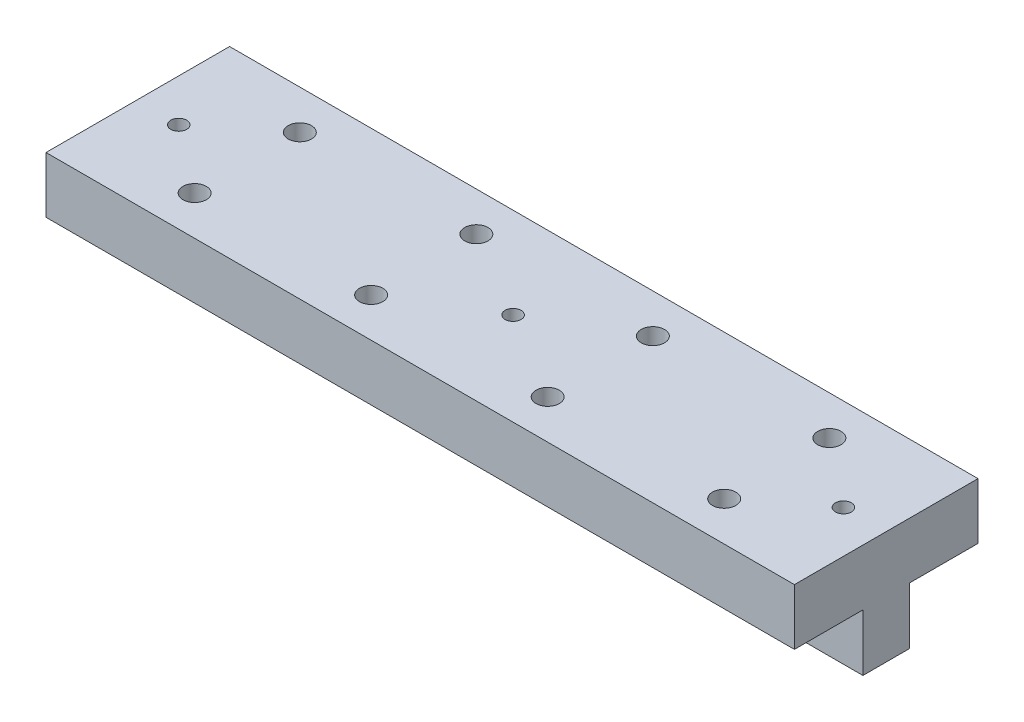
ISO-10303-21;
HEADER;
FILE_DESCRIPTION(('STEP AP214'),'2;1');
FILE_NAME('part.step','',(''),(''),'','','');
FILE_SCHEMA(('AUTOMOTIVE_DESIGN { 1 0 10303 214 1 1 1 1 }'));
ENDSEC;
DATA;
#1=APPLICATION_CONTEXT('core data for automotive mechanical design processes');
#2=APPLICATION_PROTOCOL_DEFINITION('international standard','automotive_design',2000,#1);
#3=PRODUCT_CONTEXT('',#1,'mechanical');
#4=PRODUCT('Part','Part','',(#3));
#5=PRODUCT_RELATED_PRODUCT_CATEGORY('part','',(#4));
#6=PRODUCT_DEFINITION_FORMATION('','',#4);
#7=PRODUCT_DEFINITION_CONTEXT('part definition',#1,'design');
#8=PRODUCT_DEFINITION('design','',#6,#7);
#9=PRODUCT_DEFINITION_SHAPE('','',#8);
#10=(LENGTH_UNIT() NAMED_UNIT(*) SI_UNIT(.MILLI.,.METRE.));
#11=(NAMED_UNIT(*) PLANE_ANGLE_UNIT() SI_UNIT($,.RADIAN.));
#12=(NAMED_UNIT(*) SI_UNIT($,.STERADIAN.) SOLID_ANGLE_UNIT());
#13=UNCERTAINTY_MEASURE_WITH_UNIT(LENGTH_MEASURE(1.E-05),#10,'distance_accuracy_value','');
#14=(GEOMETRIC_REPRESENTATION_CONTEXT(3) GLOBAL_UNCERTAINTY_ASSIGNED_CONTEXT((#13)) GLOBAL_UNIT_ASSIGNED_CONTEXT((#10,
#11,#12)) REPRESENTATION_CONTEXT('',''));
#15=CARTESIAN_POINT('',(0.,0.,0.));
#16=DIRECTION('',(0.,0.,1.));
#17=DIRECTION('',(1.,0.,0.));
#18=AXIS2_PLACEMENT_3D('',#15,#16,#17);
#19=CARTESIAN_POINT('',(-89.8910476017454,-16.65,-13.));
#20=DIRECTION('',(0.,1.,0.));
#21=DIRECTION('',(0.,0.,1.));
#22=AXIS2_PLACEMENT_3D('',#19,#20,#21);
#23=PLANE('',#22);
#24=CARTESIAN_POINT('',(-83.8910476017454,-16.65,-12.8014145682755));
#25=DIRECTION('',(0.,-1.,0.));
#26=DIRECTION('',(0.,0.,-1.));
#27=AXIS2_PLACEMENT_3D('',#24,#25,#26);
#28=CIRCLE('',#27,1.1303);
#29=CARTESIAN_POINT('',(-83.8910476017454,-16.65,-13.9317145682755));
#30=VERTEX_POINT('',#29);
#31=EDGE_CURVE('E470',#30,#30,#28,.T.);
#32=ORIENTED_EDGE('',*,*,#31,.T.);
#33=EDGE_LOOP('',(#32));
#34=FACE_BOUND('',#33,.T.);
#35=DIRECTION('',(-1.,0.,0.));
#36=VECTOR('',#35,1.);
#37=CARTESIAN_POINT('',(-89.8910476017454,-16.65,0.));
#38=LINE('',#37,#36);
#39=CARTESIAN_POINT('',(16.1089523982546,-16.65,0.));
#40=VERTEX_POINT('',#39);
#41=CARTESIAN_POINT('',(-89.8910476017454,-16.65,0.));
#42=VERTEX_POINT('',#41);
#43=EDGE_CURVE('E166',#40,#42,#38,.T.);
#44=ORIENTED_EDGE('',*,*,#43,.F.);
#45=DIRECTION('',(0.,0.,1.));
#46=VECTOR('',#45,1.);
#47=CARTESIAN_POINT('',(16.1089523982546,-16.65,-13.));
#48=LINE('',#47,#46);
#49=CARTESIAN_POINT('',(16.1089523982546,-16.65,-26.));
#50=VERTEX_POINT('',#49);
#51=EDGE_CURVE('E173',#50,#40,#48,.T.);
#52=ORIENTED_EDGE('',*,*,#51,.F.);
#53=DIRECTION('',(-1.,0.,0.));
#54=VECTOR('',#53,1.);
#55=CARTESIAN_POINT('',(-89.8910476017454,-16.65,-26.));
#56=LINE('',#55,#54);
#57=CARTESIAN_POINT('',(-89.8910476017454,-16.65,-26.));
#58=VERTEX_POINT('',#57);
#59=EDGE_CURVE('E121',#50,#58,#56,.T.);
#60=ORIENTED_EDGE('',*,*,#59,.T.);
#61=DIRECTION('',(0.,0.,1.));
#62=VECTOR('',#61,1.);
#63=CARTESIAN_POINT('',(-89.8910476017454,-16.65,-13.));
#64=LINE('',#63,#62);
#65=EDGE_CURVE('E170',#58,#42,#64,.T.);
#66=ORIENTED_EDGE('',*,*,#65,.T.);
#67=EDGE_LOOP('',(#44,#52,#60,#66));
#68=FACE_BOUND('',#67,.T.);
#69=CARTESIAN_POINT('',(-24.3910476017454,-16.65,-5.55));
#70=DIRECTION('',(0.,1.,0.));
#71=DIRECTION('',(0.,0.,1.));
#72=AXIS2_PLACEMENT_3D('',#69,#70,#71);
#73=CIRCLE('',#72,1.65);
#74=CARTESIAN_POINT('',(-24.3910476017454,-16.65,-3.9));
#75=VERTEX_POINT('',#74);
#76=EDGE_CURVE('E144',#75,#75,#73,.T.);
#77=ORIENTED_EDGE('',*,*,#76,.F.);
#78=EDGE_LOOP('',(#77));
#79=FACE_BOUND('',#78,.T.);
#80=CARTESIAN_POINT('',(0.608952398254592,-16.65,-5.55));
#81=DIRECTION('',(0.,1.,0.));
#82=DIRECTION('',(0.,0.,1.));
#83=AXIS2_PLACEMENT_3D('',#80,#81,#82);
#84=CIRCLE('',#83,1.65);
#85=CARTESIAN_POINT('',(0.608952398254592,-16.65,-3.9));
#86=VERTEX_POINT('',#85);
#87=EDGE_CURVE('E140',#86,#86,#84,.T.);
#88=ORIENTED_EDGE('',*,*,#87,.F.);
#89=EDGE_LOOP('',(#88));
#90=FACE_BOUND('',#89,.T.);
#91=CARTESIAN_POINT('',(-49.3910476017454,-16.65,-5.55));
#92=DIRECTION('',(0.,1.,0.));
#93=DIRECTION('',(0.,0.,1.));
#94=AXIS2_PLACEMENT_3D('',#91,#92,#93);
#95=CIRCLE('',#94,1.65);
#96=CARTESIAN_POINT('',(-49.3910476017454,-16.65,-3.9));
#97=VERTEX_POINT('',#96);
#98=EDGE_CURVE('E136',#97,#97,#95,.T.);
#99=ORIENTED_EDGE('',*,*,#98,.F.);
#100=EDGE_LOOP('',(#99));
#101=FACE_BOUND('',#100,.T.);
#102=CARTESIAN_POINT('',(-74.3910476017454,-16.65,-5.55));
#103=DIRECTION('',(0.,1.,0.));
#104=DIRECTION('',(0.,0.,1.));
#105=AXIS2_PLACEMENT_3D('',#102,#103,#104);
#106=CIRCLE('',#105,1.65);
#107=CARTESIAN_POINT('',(-74.3910476017454,-16.65,-3.9));
#108=VERTEX_POINT('',#107);
#109=EDGE_CURVE('E130',#108,#108,#106,.T.);
#110=ORIENTED_EDGE('',*,*,#109,.F.);
#111=EDGE_LOOP('',(#110));
#112=FACE_BOUND('',#111,.T.);
#113=CARTESIAN_POINT('',(-24.3910476017454,-16.65,-20.45));
#114=DIRECTION('',(0.,1.,0.));
#115=DIRECTION('',(0.,0.,1.));
#116=AXIS2_PLACEMENT_3D('',#113,#114,#115);
#117=CIRCLE('',#116,1.65);
#118=CARTESIAN_POINT('',(-24.3910476017454,-16.65,-18.8));
#119=VERTEX_POINT('',#118);
#120=EDGE_CURVE('E189',#119,#119,#117,.T.);
#121=ORIENTED_EDGE('',*,*,#120,.F.);
#122=EDGE_LOOP('',(#121));
#123=FACE_BOUND('',#122,.T.);
#124=CARTESIAN_POINT('',(0.608952398254592,-16.65,-20.45));
#125=DIRECTION('',(0.,1.,0.));
#126=DIRECTION('',(0.,0.,1.));
#127=AXIS2_PLACEMENT_3D('',#124,#125,#126);
#128=CIRCLE('',#127,1.65);
#129=CARTESIAN_POINT('',(0.608952398254592,-16.65,-18.8));
#130=VERTEX_POINT('',#129);
#131=EDGE_CURVE('E190',#130,#130,#128,.T.);
#132=ORIENTED_EDGE('',*,*,#131,.F.);
#133=EDGE_LOOP('',(#132));
#134=FACE_BOUND('',#133,.T.);
#135=CARTESIAN_POINT('',(-49.3910476017454,-16.65,-20.45));
#136=DIRECTION('',(0.,1.,0.));
#137=DIRECTION('',(0.,0.,1.));
#138=AXIS2_PLACEMENT_3D('',#135,#136,#137);
#139=CIRCLE('',#138,1.65);
#140=CARTESIAN_POINT('',(-49.3910476017454,-16.65,-18.8));
#141=VERTEX_POINT('',#140);
#142=EDGE_CURVE('E201',#141,#141,#139,.T.);
#143=ORIENTED_EDGE('',*,*,#142,.F.);
#144=EDGE_LOOP('',(#143));
#145=FACE_BOUND('',#144,.T.);
#146=CARTESIAN_POINT('',(-74.3910476017454,-16.65,-20.45));
#147=DIRECTION('',(0.,1.,0.));
#148=DIRECTION('',(0.,0.,1.));
#149=AXIS2_PLACEMENT_3D('',#146,#147,#148);
#150=CIRCLE('',#149,1.65);
#151=CARTESIAN_POINT('',(-74.3910476017454,-16.65,-18.8));
#152=VERTEX_POINT('',#151);
#153=EDGE_CURVE('E456',#152,#152,#150,.T.);
#154=ORIENTED_EDGE('',*,*,#153,.F.);
#155=EDGE_LOOP('',(#154));
#156=FACE_BOUND('',#155,.T.);
#157=CARTESIAN_POINT('',(-36.8910476017454,-16.65,-13.1568071765675));
#158=DIRECTION('',(0.,-1.,0.));
#159=DIRECTION('',(0.,0.,-1.));
#160=AXIS2_PLACEMENT_3D('',#157,#158,#159);
#161=CIRCLE('',#160,1.13029999999999);
#162=CARTESIAN_POINT('',(-36.8910476017454,-16.65,-14.2871071765675));
#163=VERTEX_POINT('',#162);
#164=EDGE_CURVE('E460',#163,#163,#161,.T.);
#165=ORIENTED_EDGE('',*,*,#164,.T.);
#166=EDGE_LOOP('',(#165));
#167=FACE_BOUND('',#166,.T.);
#168=CARTESIAN_POINT('',(10.1089523982546,-16.65,-12.9381847081124));
#169=DIRECTION('',(0.,-1.,0.));
#170=DIRECTION('',(0.,0.,-1.));
#171=AXIS2_PLACEMENT_3D('',#168,#169,#170);
#172=CIRCLE('',#171,1.1303);
#173=CARTESIAN_POINT('',(10.1089523982546,-16.65,-14.0684847081123));
#174=VERTEX_POINT('',#173);
#175=EDGE_CURVE('E463',#174,#174,#172,.T.);
#176=ORIENTED_EDGE('',*,*,#175,.T.);
#177=EDGE_LOOP('',(#176));
#178=FACE_BOUND('',#177,.T.);
#179=ADVANCED_FACE('F35',(#34,#68,#79,#90,#101,#112,#123,#134,#145,#156,#167,#178),#23,.T.);
#180=CARTESIAN_POINT('',(-89.8910476017454,-32.65,-13.));
#181=DIRECTION('',(0.,-1.,0.));
#182=DIRECTION('',(0.,0.,-1.));
#183=AXIS2_PLACEMENT_3D('',#180,#181,#182);
#184=PLANE('',#183);
#185=CARTESIAN_POINT('',(-83.8910476017454,-32.65,-12.8014145682755));
#186=DIRECTION('',(0.,-1.,0.));
#187=DIRECTION('',(0.,0.,-1.));
#188=AXIS2_PLACEMENT_3D('',#185,#186,#187);
#189=CIRCLE('',#188,1.1303);
#190=CARTESIAN_POINT('',(-83.8910476017454,-32.65,-13.9317145682755));
#191=VERTEX_POINT('',#190);
#192=EDGE_CURVE('E485',#191,#191,#189,.T.);
#193=ORIENTED_EDGE('',*,*,#192,.F.);
#194=EDGE_LOOP('',(#193));
#195=FACE_BOUND('',#194,.T.);
#196=CARTESIAN_POINT('',(10.1089523982546,-32.65,-12.9381847081124));
#197=DIRECTION('',(0.,-1.,0.));
#198=DIRECTION('',(0.,0.,-1.));
#199=AXIS2_PLACEMENT_3D('',#196,#197,#198);
#200=CIRCLE('',#199,1.1303);
#201=CARTESIAN_POINT('',(10.1089523982546,-32.65,-14.0684847081124));
#202=VERTEX_POINT('',#201);
#203=EDGE_CURVE('E465',#202,#202,#200,.T.);
#204=ORIENTED_EDGE('',*,*,#203,.F.);
#205=EDGE_LOOP('',(#204));
#206=FACE_BOUND('',#205,.T.);
#207=CARTESIAN_POINT('',(-36.8910476017454,-32.65,-13.1568071765675));
#208=DIRECTION('',(0.,-1.,0.));
#209=DIRECTION('',(0.,0.,-1.));
#210=AXIS2_PLACEMENT_3D('',#207,#208,#209);
#211=CIRCLE('',#210,1.1303);
#212=CARTESIAN_POINT('',(-36.8910476017454,-32.65,-14.2871071765675));
#213=VERTEX_POINT('',#212);
#214=EDGE_CURVE('E464',#213,#213,#211,.T.);
#215=ORIENTED_EDGE('',*,*,#214,.F.);
#216=EDGE_LOOP('',(#215));
#217=FACE_BOUND('',#216,.T.);
#218=DIRECTION('',(0.,0.,1.));
#219=VECTOR('',#218,1.);
#220=CARTESIAN_POINT('',(-89.8910476017454,-32.65,-13.));
#221=LINE('',#220,#219);
#222=CARTESIAN_POINT('',(-89.8910476017454,-32.65,-16.3));
#223=VERTEX_POINT('',#222);
#224=CARTESIAN_POINT('',(-89.8910476017454,-32.65,-9.7));
#225=VERTEX_POINT('',#224);
#226=EDGE_CURVE('E169',#223,#225,#221,.T.);
#227=ORIENTED_EDGE('',*,*,#226,.F.);
#228=DIRECTION('',(1.,0.,0.));
#229=VECTOR('',#228,1.);
#230=CARTESIAN_POINT('',(-89.8910476017454,-32.65,-16.3));
#231=LINE('',#230,#229);
#232=CARTESIAN_POINT('',(16.1089523982546,-32.65,-16.3));
#233=VERTEX_POINT('',#232);
#234=EDGE_CURVE('E11',#223,#233,#231,.T.);
#235=ORIENTED_EDGE('',*,*,#234,.T.);
#236=DIRECTION('',(0.,0.,1.));
#237=VECTOR('',#236,1.);
#238=CARTESIAN_POINT('',(16.1089523982546,-32.65,-13.));
#239=LINE('',#238,#237);
#240=CARTESIAN_POINT('',(16.1089523982546,-32.65,-9.7));
#241=VERTEX_POINT('',#240);
#242=EDGE_CURVE('E176',#233,#241,#239,.T.);
#243=ORIENTED_EDGE('',*,*,#242,.T.);
#244=DIRECTION('',(-1.,0.,0.));
#245=VECTOR('',#244,1.);
#246=CARTESIAN_POINT('',(-89.8910476017454,-32.65,-9.7));
#247=LINE('',#246,#245);
#248=EDGE_CURVE('E180',#241,#225,#247,.T.);
#249=ORIENTED_EDGE('',*,*,#248,.T.);
#250=EDGE_LOOP('',(#227,#235,#243,#249));
#251=FACE_BOUND('',#250,.T.);
#252=ADVANCED_FACE('F212',(#195,#206,#217,#251),#184,.T.);
#253=CARTESIAN_POINT('',(-89.8910476017454,-16.65,-13.));
#254=DIRECTION('',(-1.,0.,0.));
#255=DIRECTION('',(0.,0.,1.));
#256=AXIS2_PLACEMENT_3D('',#253,#254,#255);
#257=PLANE('',#256);
#258=DIRECTION('',(0.,0.,1.));
#259=VECTOR('',#258,1.);
#260=CARTESIAN_POINT('',(-89.8910476017454,-24.6013169762694,-26.000012));
#261=LINE('',#260,#259);
#262=CARTESIAN_POINT('',(-89.8910476017454,-24.6013169762694,-26.));
#263=VERTEX_POINT('',#262);
#264=CARTESIAN_POINT('',(-89.8910476017454,-24.6013169762694,-16.3));
#265=VERTEX_POINT('',#264);
#266=EDGE_CURVE('E52',#263,#265,#261,.T.);
#267=ORIENTED_EDGE('',*,*,#266,.T.);
#268=DIRECTION('',(0.,-1.,0.));
#269=VECTOR('',#268,1.);
#270=CARTESIAN_POINT('',(-89.8910476017454,-24.6013169762694,-16.3));
#271=LINE('',#270,#269);
#272=EDGE_CURVE('E109',#265,#223,#271,.T.);
#273=ORIENTED_EDGE('',*,*,#272,.T.);
#274=ORIENTED_EDGE('',*,*,#226,.T.);
#275=DIRECTION('',(0.,-1.,0.));
#276=VECTOR('',#275,1.);
#277=CARTESIAN_POINT('',(-89.8910476017454,-24.6013169762694,-9.7));
#278=LINE('',#277,#276);
#279=CARTESIAN_POINT('',(-89.8910476017454,-24.6013169762694,-9.7));
#280=VERTEX_POINT('',#279);
#281=EDGE_CURVE('E150',#280,#225,#278,.T.);
#282=ORIENTED_EDGE('',*,*,#281,.F.);
#283=DIRECTION('',(0.,0.,-1.));
#284=VECTOR('',#283,1.);
#285=CARTESIAN_POINT('',(-89.8910476017454,-24.6013169762694,1.2E-05));
#286=LINE('',#285,#284);
#287=CARTESIAN_POINT('',(-89.8910476017454,-24.6013169762694,0.));
#288=VERTEX_POINT('',#287);
#289=EDGE_CURVE('E158',#288,#280,#286,.T.);
#290=ORIENTED_EDGE('',*,*,#289,.F.);
#291=DIRECTION('',(0.,-1.,0.));
#292=VECTOR('',#291,1.);
#293=CARTESIAN_POINT('',(-89.8910476017454,-16.65,0.));
#294=LINE('',#293,#292);
#295=EDGE_CURVE('E161',#42,#288,#294,.T.);
#296=ORIENTED_EDGE('',*,*,#295,.F.);
#297=ORIENTED_EDGE('',*,*,#65,.F.);
#298=DIRECTION('',(0.,-1.,0.));
#299=VECTOR('',#298,1.);
#300=CARTESIAN_POINT('',(-89.8910476017454,-16.65,-26.));
#301=LINE('',#300,#299);
#302=EDGE_CURVE('E119',#58,#263,#301,.T.);
#303=ORIENTED_EDGE('',*,*,#302,.T.);
#304=EDGE_LOOP('',(#267,#273,#274,#282,#290,#296,#297,#303));
#305=FACE_BOUND('',#304,.T.);
#306=ADVANCED_FACE('F37',(#305),#257,.T.);
#307=CARTESIAN_POINT('',(16.1089523982546,-16.65,-13.));
#308=DIRECTION('',(1.,0.,0.));
#309=DIRECTION('',(0.,0.,-1.));
#310=AXIS2_PLACEMENT_3D('',#307,#308,#309);
#311=PLANE('',#310);
#312=DIRECTION('',(0.,0.,1.));
#313=VECTOR('',#312,1.);
#314=CARTESIAN_POINT('',(16.1089523982546,-24.6013169762694,-26.000012));
#315=LINE('',#314,#313);
#316=CARTESIAN_POINT('',(16.1089523982546,-24.6013169762694,-26.));
#317=VERTEX_POINT('',#316);
#318=CARTESIAN_POINT('',(16.1089523982546,-24.6013169762694,-16.3));
#319=VERTEX_POINT('',#318);
#320=EDGE_CURVE('E105',#317,#319,#315,.T.);
#321=ORIENTED_EDGE('',*,*,#320,.F.);
#322=DIRECTION('',(0.,1.,0.));
#323=VECTOR('',#322,1.);
#324=CARTESIAN_POINT('',(16.1089523982546,-16.65,-26.));
#325=LINE('',#324,#323);
#326=EDGE_CURVE('E128',#317,#50,#325,.T.);
#327=ORIENTED_EDGE('',*,*,#326,.T.);
#328=ORIENTED_EDGE('',*,*,#51,.T.);
#329=DIRECTION('',(0.,1.,0.));
#330=VECTOR('',#329,1.);
#331=CARTESIAN_POINT('',(16.1089523982546,-16.65,0.));
#332=LINE('',#331,#330);
#333=CARTESIAN_POINT('',(16.1089523982546,-24.6013169762694,0.));
#334=VERTEX_POINT('',#333);
#335=EDGE_CURVE('E164',#334,#40,#332,.T.);
#336=ORIENTED_EDGE('',*,*,#335,.F.);
#337=DIRECTION('',(0.,0.,-1.));
#338=VECTOR('',#337,1.);
#339=CARTESIAN_POINT('',(16.1089523982546,-24.6013169762694,1.2E-05));
#340=LINE('',#339,#338);
#341=CARTESIAN_POINT('',(16.1089523982546,-24.6013169762694,-9.7));
#342=VERTEX_POINT('',#341);
#343=EDGE_CURVE('E60',#334,#342,#340,.T.);
#344=ORIENTED_EDGE('',*,*,#343,.T.);
#345=DIRECTION('',(0.,1.,0.));
#346=VECTOR('',#345,1.);
#347=CARTESIAN_POINT('',(16.1089523982546,-24.6013169762694,-9.7));
#348=LINE('',#347,#346);
#349=EDGE_CURVE('E153',#241,#342,#348,.T.);
#350=ORIENTED_EDGE('',*,*,#349,.F.);
#351=ORIENTED_EDGE('',*,*,#242,.F.);
#352=DIRECTION('',(0.,1.,0.));
#353=VECTOR('',#352,1.);
#354=CARTESIAN_POINT('',(16.1089523982546,-24.6013169762694,-16.3));
#355=LINE('',#354,#353);
#356=EDGE_CURVE('E108',#233,#319,#355,.T.);
#357=ORIENTED_EDGE('',*,*,#356,.T.);
#358=EDGE_LOOP('',(#321,#327,#328,#336,#344,#350,#351,#357));
#359=FACE_BOUND('',#358,.T.);
#360=ADVANCED_FACE('F208',(#359),#311,.T.);
#361=CARTESIAN_POINT('',(0.,0.,0.));
#362=DIRECTION('',(0.,0.,1.));
#363=DIRECTION('',(1.,0.,0.));
#364=AXIS2_PLACEMENT_3D('',#361,#362,#363);
#365=PLANE('',#364);
#366=ORIENTED_EDGE('',*,*,#295,.T.);
#367=DIRECTION('',(1.,0.,0.));
#368=VECTOR('',#367,1.);
#369=CARTESIAN_POINT('',(0.,-24.6013169762694,0.));
#370=LINE('',#369,#368);
#371=EDGE_CURVE('E172',#288,#334,#370,.T.);
#372=ORIENTED_EDGE('',*,*,#371,.T.);
#373=ORIENTED_EDGE('',*,*,#335,.T.);
#374=ORIENTED_EDGE('',*,*,#43,.T.);
#375=EDGE_LOOP('',(#366,#372,#373,#374));
#376=FACE_BOUND('',#375,.T.);
#377=ADVANCED_FACE('F223',(#376),#365,.T.);
#378=CARTESIAN_POINT('',(-89.8910476017454,-24.6013169762694,1.2E-05));
#379=DIRECTION('',(0.,-1.,0.));
#380=DIRECTION('',(0.,0.,-1.));
#381=AXIS2_PLACEMENT_3D('',#378,#379,#380);
#382=PLANE('',#381);
#383=CARTESIAN_POINT('',(-74.3910476017454,-24.6013169762694,-5.55));
#384=DIRECTION('',(0.,-1.,0.));
#385=DIRECTION('',(0.,0.,-1.));
#386=AXIS2_PLACEMENT_3D('',#383,#384,#385);
#387=CIRCLE('',#386,1.65);
#388=CARTESIAN_POINT('',(-74.3910476017454,-24.6013169762694,-7.2));
#389=VERTEX_POINT('',#388);
#390=EDGE_CURVE('E133',#389,#389,#387,.T.);
#391=ORIENTED_EDGE('',*,*,#390,.F.);
#392=EDGE_LOOP('',(#391));
#393=FACE_BOUND('',#392,.T.);
#394=CARTESIAN_POINT('',(-49.3910476017454,-24.6013169762694,-5.55));
#395=DIRECTION('',(0.,-1.,0.));
#396=DIRECTION('',(0.,0.,-1.));
#397=AXIS2_PLACEMENT_3D('',#394,#395,#396);
#398=CIRCLE('',#397,1.65);
#399=CARTESIAN_POINT('',(-49.3910476017454,-24.6013169762694,-7.2));
#400=VERTEX_POINT('',#399);
#401=EDGE_CURVE('E139',#400,#400,#398,.T.);
#402=ORIENTED_EDGE('',*,*,#401,.F.);
#403=EDGE_LOOP('',(#402));
#404=FACE_BOUND('',#403,.T.);
#405=CARTESIAN_POINT('',(0.608952398254592,-24.6013169762694,-5.55));
#406=DIRECTION('',(0.,-1.,0.));
#407=DIRECTION('',(0.,0.,-1.));
#408=AXIS2_PLACEMENT_3D('',#405,#406,#407);
#409=CIRCLE('',#408,1.65);
#410=CARTESIAN_POINT('',(0.608952398254592,-24.6013169762694,-7.2));
#411=VERTEX_POINT('',#410);
#412=EDGE_CURVE('E143',#411,#411,#409,.T.);
#413=ORIENTED_EDGE('',*,*,#412,.F.);
#414=EDGE_LOOP('',(#413));
#415=FACE_BOUND('',#414,.T.);
#416=CARTESIAN_POINT('',(-24.3910476017454,-24.6013169762694,-5.55));
#417=DIRECTION('',(0.,-1.,0.));
#418=DIRECTION('',(0.,0.,-1.));
#419=AXIS2_PLACEMENT_3D('',#416,#417,#418);
#420=CIRCLE('',#419,1.65);
#421=CARTESIAN_POINT('',(-24.3910476017454,-24.6013169762694,-7.2));
#422=VERTEX_POINT('',#421);
#423=EDGE_CURVE('E147',#422,#422,#420,.T.);
#424=ORIENTED_EDGE('',*,*,#423,.F.);
#425=EDGE_LOOP('',(#424));
#426=FACE_BOUND('',#425,.T.);
#427=ORIENTED_EDGE('',*,*,#289,.T.);
#428=DIRECTION('',(-1.,0.,0.));
#429=VECTOR('',#428,1.);
#430=CARTESIAN_POINT('',(-89.8910476017454,-24.6013169762694,-9.7));
#431=LINE('',#430,#429);
#432=EDGE_CURVE('E155',#342,#280,#431,.T.);
#433=ORIENTED_EDGE('',*,*,#432,.F.);
#434=ORIENTED_EDGE('',*,*,#343,.F.);
#435=ORIENTED_EDGE('',*,*,#371,.F.);
#436=EDGE_LOOP('',(#427,#433,#434,#435));
#437=FACE_BOUND('',#436,.T.);
#438=ADVANCED_FACE('F218',(#393,#404,#415,#426,#437),#382,.T.);
#439=CARTESIAN_POINT('',(0.,0.,-9.7));
#440=DIRECTION('',(0.,0.,1.));
#441=DIRECTION('',(1.,0.,0.));
#442=AXIS2_PLACEMENT_3D('',#439,#440,#441);
#443=PLANE('',#442);
#444=ORIENTED_EDGE('',*,*,#349,.T.);
#445=ORIENTED_EDGE('',*,*,#432,.T.);
#446=ORIENTED_EDGE('',*,*,#281,.T.);
#447=ORIENTED_EDGE('',*,*,#248,.F.);
#448=EDGE_LOOP('',(#444,#445,#446,#447));
#449=FACE_BOUND('',#448,.T.);
#450=ADVANCED_FACE('F217',(#449),#443,.T.);
#451=CARTESIAN_POINT('',(-24.3910476017454,-16.65,-5.55));
#452=DIRECTION('',(0.,1.,0.));
#453=DIRECTION('',(0.,0.,1.));
#454=AXIS2_PLACEMENT_3D('',#451,#452,#453);
#455=CYLINDRICAL_SURFACE('',#454,1.65);
#456=ORIENTED_EDGE('',*,*,#423,.T.);
#457=EDGE_LOOP('',(#456));
#458=FACE_BOUND('',#457,.T.);
#459=ORIENTED_EDGE('',*,*,#76,.T.);
#460=EDGE_LOOP('',(#459));
#461=FACE_BOUND('',#460,.T.);
#462=ADVANCED_FACE('F391',(#458,#461),#455,.F.);
#463=CARTESIAN_POINT('',(0.608952398254592,-16.65,-5.55));
#464=DIRECTION('',(0.,1.,0.));
#465=DIRECTION('',(0.,0.,1.));
#466=AXIS2_PLACEMENT_3D('',#463,#464,#465);
#467=CYLINDRICAL_SURFACE('',#466,1.65);
#468=ORIENTED_EDGE('',*,*,#412,.T.);
#469=EDGE_LOOP('',(#468));
#470=FACE_BOUND('',#469,.T.);
#471=ORIENTED_EDGE('',*,*,#87,.T.);
#472=EDGE_LOOP('',(#471));
#473=FACE_BOUND('',#472,.T.);
#474=ADVANCED_FACE('F381',(#470,#473),#467,.F.);
#475=CARTESIAN_POINT('',(-49.3910476017454,-16.65,-5.55));
#476=DIRECTION('',(0.,1.,0.));
#477=DIRECTION('',(0.,0.,1.));
#478=AXIS2_PLACEMENT_3D('',#475,#476,#477);
#479=CYLINDRICAL_SURFACE('',#478,1.65);
#480=ORIENTED_EDGE('',*,*,#401,.T.);
#481=EDGE_LOOP('',(#480));
#482=FACE_BOUND('',#481,.T.);
#483=ORIENTED_EDGE('',*,*,#98,.T.);
#484=EDGE_LOOP('',(#483));
#485=FACE_BOUND('',#484,.T.);
#486=ADVANCED_FACE('F239',(#482,#485),#479,.F.);
#487=CARTESIAN_POINT('',(-74.3910476017454,-16.65,-5.55));
#488=DIRECTION('',(0.,1.,0.));
#489=DIRECTION('',(0.,0.,1.));
#490=AXIS2_PLACEMENT_3D('',#487,#488,#489);
#491=CYLINDRICAL_SURFACE('',#490,1.65);
#492=ORIENTED_EDGE('',*,*,#390,.T.);
#493=EDGE_LOOP('',(#492));
#494=FACE_BOUND('',#493,.T.);
#495=ORIENTED_EDGE('',*,*,#109,.T.);
#496=EDGE_LOOP('',(#495));
#497=FACE_BOUND('',#496,.T.);
#498=ADVANCED_FACE('F231',(#494,#497),#491,.F.);
#499=CARTESIAN_POINT('',(0.,0.,-26.));
#500=DIRECTION('',(0.,0.,-1.));
#501=DIRECTION('',(1.,0.,0.));
#502=AXIS2_PLACEMENT_3D('',#499,#500,#501);
#503=PLANE('',#502);
#504=DIRECTION('',(1.,0.,0.));
#505=VECTOR('',#504,1.);
#506=CARTESIAN_POINT('',(0.,-24.6013169762694,-26.));
#507=LINE('',#506,#505);
#508=EDGE_CURVE('E44',#263,#317,#507,.T.);
#509=ORIENTED_EDGE('',*,*,#508,.F.);
#510=ORIENTED_EDGE('',*,*,#302,.F.);
#511=ORIENTED_EDGE('',*,*,#59,.F.);
#512=ORIENTED_EDGE('',*,*,#326,.F.);
#513=EDGE_LOOP('',(#509,#510,#511,#512));
#514=FACE_BOUND('',#513,.T.);
#515=ADVANCED_FACE('F229',(#514),#503,.T.);
#516=CARTESIAN_POINT('',(-89.8910476017454,-24.6013169762694,-26.000012));
#517=DIRECTION('',(0.,1.,0.));
#518=DIRECTION('',(0.,0.,1.));
#519=AXIS2_PLACEMENT_3D('',#516,#517,#518);
#520=PLANE('',#519);
#521=CARTESIAN_POINT('',(-74.3910476017454,-24.6013169762694,-20.45));
#522=DIRECTION('',(0.,1.,0.));
#523=DIRECTION('',(0.,0.,1.));
#524=AXIS2_PLACEMENT_3D('',#521,#522,#523);
#525=CIRCLE('',#524,1.65);
#526=CARTESIAN_POINT('',(-74.3910476017454,-24.6013169762694,-18.8));
#527=VERTEX_POINT('',#526);
#528=EDGE_CURVE('E39',#527,#527,#525,.T.);
#529=ORIENTED_EDGE('',*,*,#528,.T.);
#530=EDGE_LOOP('',(#529));
#531=FACE_BOUND('',#530,.T.);
#532=CARTESIAN_POINT('',(-49.3910476017454,-24.6013169762694,-20.45));
#533=DIRECTION('',(0.,1.,0.));
#534=DIRECTION('',(0.,0.,1.));
#535=AXIS2_PLACEMENT_3D('',#532,#533,#534);
#536=CIRCLE('',#535,1.65);
#537=CARTESIAN_POINT('',(-49.3910476017454,-24.6013169762694,-18.8));
#538=VERTEX_POINT('',#537);
#539=EDGE_CURVE('E196',#538,#538,#536,.T.);
#540=ORIENTED_EDGE('',*,*,#539,.T.);
#541=EDGE_LOOP('',(#540));
#542=FACE_BOUND('',#541,.T.);
#543=CARTESIAN_POINT('',(0.608952398254592,-24.6013169762694,-20.45));
#544=DIRECTION('',(0.,1.,0.));
#545=DIRECTION('',(0.,0.,1.));
#546=AXIS2_PLACEMENT_3D('',#543,#544,#545);
#547=CIRCLE('',#546,1.65);
#548=CARTESIAN_POINT('',(0.608952398254592,-24.6013169762694,-18.8));
#549=VERTEX_POINT('',#548);
#550=EDGE_CURVE('E187',#549,#549,#547,.T.);
#551=ORIENTED_EDGE('',*,*,#550,.T.);
#552=EDGE_LOOP('',(#551));
#553=FACE_BOUND('',#552,.T.);
#554=CARTESIAN_POINT('',(-24.3910476017454,-24.6013169762694,-20.45));
#555=DIRECTION('',(0.,1.,0.));
#556=DIRECTION('',(0.,0.,1.));
#557=AXIS2_PLACEMENT_3D('',#554,#555,#556);
#558=CIRCLE('',#557,1.65);
#559=CARTESIAN_POINT('',(-24.3910476017454,-24.6013169762694,-18.8));
#560=VERTEX_POINT('',#559);
#561=EDGE_CURVE('E115',#560,#560,#558,.T.);
#562=ORIENTED_EDGE('',*,*,#561,.T.);
#563=EDGE_LOOP('',(#562));
#564=FACE_BOUND('',#563,.T.);
#565=ORIENTED_EDGE('',*,*,#508,.T.);
#566=ORIENTED_EDGE('',*,*,#320,.T.);
#567=DIRECTION('',(-1.,0.,0.));
#568=VECTOR('',#567,1.);
#569=CARTESIAN_POINT('',(-89.8910476017454,-24.6013169762694,-16.3));
#570=LINE('',#569,#568);
#571=EDGE_CURVE('E101',#319,#265,#570,.T.);
#572=ORIENTED_EDGE('',*,*,#571,.T.);
#573=ORIENTED_EDGE('',*,*,#266,.F.);
#574=EDGE_LOOP('',(#565,#566,#572,#573));
#575=FACE_BOUND('',#574,.T.);
#576=ADVANCED_FACE('F103',(#531,#542,#553,#564,#575),#520,.F.);
#577=CARTESIAN_POINT('',(0.,0.,-16.3));
#578=DIRECTION('',(0.,0.,-1.));
#579=DIRECTION('',(1.,0.,0.));
#580=AXIS2_PLACEMENT_3D('',#577,#578,#579);
#581=PLANE('',#580);
#582=ORIENTED_EDGE('',*,*,#272,.F.);
#583=ORIENTED_EDGE('',*,*,#571,.F.);
#584=ORIENTED_EDGE('',*,*,#356,.F.);
#585=ORIENTED_EDGE('',*,*,#234,.F.);
#586=EDGE_LOOP('',(#582,#583,#584,#585));
#587=FACE_BOUND('',#586,.T.);
#588=ADVANCED_FACE('F112',(#587),#581,.T.);
#589=CARTESIAN_POINT('',(-24.3910476017454,-16.65,-20.45));
#590=DIRECTION('',(0.,1.,0.));
#591=DIRECTION('',(0.,0.,1.));
#592=AXIS2_PLACEMENT_3D('',#589,#590,#591);
#593=CYLINDRICAL_SURFACE('',#592,1.65);
#594=ORIENTED_EDGE('',*,*,#120,.T.);
#595=EDGE_LOOP('',(#594));
#596=FACE_BOUND('',#595,.T.);
#597=ORIENTED_EDGE('',*,*,#561,.F.);
#598=EDGE_LOOP('',(#597));
#599=FACE_BOUND('',#598,.T.);
#600=ADVANCED_FACE('F331',(#596,#599),#593,.F.);
#601=CARTESIAN_POINT('',(0.608952398254592,-16.65,-20.45));
#602=DIRECTION('',(0.,1.,0.));
#603=DIRECTION('',(0.,0.,1.));
#604=AXIS2_PLACEMENT_3D('',#601,#602,#603);
#605=CYLINDRICAL_SURFACE('',#604,1.65);
#606=ORIENTED_EDGE('',*,*,#131,.T.);
#607=EDGE_LOOP('',(#606));
#608=FACE_BOUND('',#607,.T.);
#609=ORIENTED_EDGE('',*,*,#550,.F.);
#610=EDGE_LOOP('',(#609));
#611=FACE_BOUND('',#610,.T.);
#612=ADVANCED_FACE('F323',(#608,#611),#605,.F.);
#613=CARTESIAN_POINT('',(-49.3910476017454,-16.65,-20.45));
#614=DIRECTION('',(0.,1.,0.));
#615=DIRECTION('',(0.,0.,1.));
#616=AXIS2_PLACEMENT_3D('',#613,#614,#615);
#617=CYLINDRICAL_SURFACE('',#616,1.65);
#618=ORIENTED_EDGE('',*,*,#142,.T.);
#619=EDGE_LOOP('',(#618));
#620=FACE_BOUND('',#619,.T.);
#621=ORIENTED_EDGE('',*,*,#539,.F.);
#622=EDGE_LOOP('',(#621));
#623=FACE_BOUND('',#622,.T.);
#624=ADVANCED_FACE('F316',(#620,#623),#617,.F.);
#625=CARTESIAN_POINT('',(-74.3910476017454,-16.65,-20.45));
#626=DIRECTION('',(0.,1.,0.));
#627=DIRECTION('',(0.,0.,1.));
#628=AXIS2_PLACEMENT_3D('',#625,#626,#627);
#629=CYLINDRICAL_SURFACE('',#628,1.65);
#630=ORIENTED_EDGE('',*,*,#153,.T.);
#631=EDGE_LOOP('',(#630));
#632=FACE_BOUND('',#631,.T.);
#633=ORIENTED_EDGE('',*,*,#528,.F.);
#634=EDGE_LOOP('',(#633));
#635=FACE_BOUND('',#634,.T.);
#636=ADVANCED_FACE('F282',(#632,#635),#629,.F.);
#637=CARTESIAN_POINT('',(-36.8910476017454,-32.65,-13.1568071765675));
#638=DIRECTION('',(0.,-1.,0.));
#639=DIRECTION('',(0.,0.,-1.));
#640=AXIS2_PLACEMENT_3D('',#637,#638,#639);
#641=CYLINDRICAL_SURFACE('',#640,1.1303);
#642=ORIENTED_EDGE('',*,*,#164,.F.);
#643=EDGE_LOOP('',(#642));
#644=FACE_BOUND('',#643,.T.);
#645=ORIENTED_EDGE('',*,*,#214,.T.);
#646=EDGE_LOOP('',(#645));
#647=FACE_BOUND('',#646,.T.);
#648=ADVANCED_FACE('F275',(#644,#647),#641,.F.);
#649=CARTESIAN_POINT('',(10.1089523982546,-32.65,-12.9381847081124));
#650=DIRECTION('',(0.,-1.,0.));
#651=DIRECTION('',(0.,0.,-1.));
#652=AXIS2_PLACEMENT_3D('',#649,#650,#651);
#653=CYLINDRICAL_SURFACE('',#652,1.1303);
#654=ORIENTED_EDGE('',*,*,#175,.F.);
#655=EDGE_LOOP('',(#654));
#656=FACE_BOUND('',#655,.T.);
#657=ORIENTED_EDGE('',*,*,#203,.T.);
#658=EDGE_LOOP('',(#657));
#659=FACE_BOUND('',#658,.T.);
#660=ADVANCED_FACE('F281',(#656,#659),#653,.F.);
#661=CARTESIAN_POINT('',(-83.8910476017454,-32.65,-12.8014145682755));
#662=DIRECTION('',(0.,-1.,0.));
#663=DIRECTION('',(0.,0.,-1.));
#664=AXIS2_PLACEMENT_3D('',#661,#662,#663);
#665=CYLINDRICAL_SURFACE('',#664,1.1303);
#666=ORIENTED_EDGE('',*,*,#31,.F.);
#667=EDGE_LOOP('',(#666));
#668=FACE_BOUND('',#667,.T.);
#669=ORIENTED_EDGE('',*,*,#192,.T.);
#670=EDGE_LOOP('',(#669));
#671=FACE_BOUND('',#670,.T.);
#672=ADVANCED_FACE('F295',(#668,#671),#665,.F.);
#673=CLOSED_SHELL('',(#179,#252,#306,#360,#377,#438,#450,#462,#474,#486,#498,#515,#576,#588,
#600,#612,#624,#636,#648,#660,#672));
#674=MANIFOLD_SOLID_BREP('B2',#673);
#675=ADVANCED_BREP_SHAPE_REPRESENTATION('',(#18,#674),#14);
#676=SHAPE_DEFINITION_REPRESENTATION(#9,#675);
ENDSEC;
END-ISO-10303-21;
